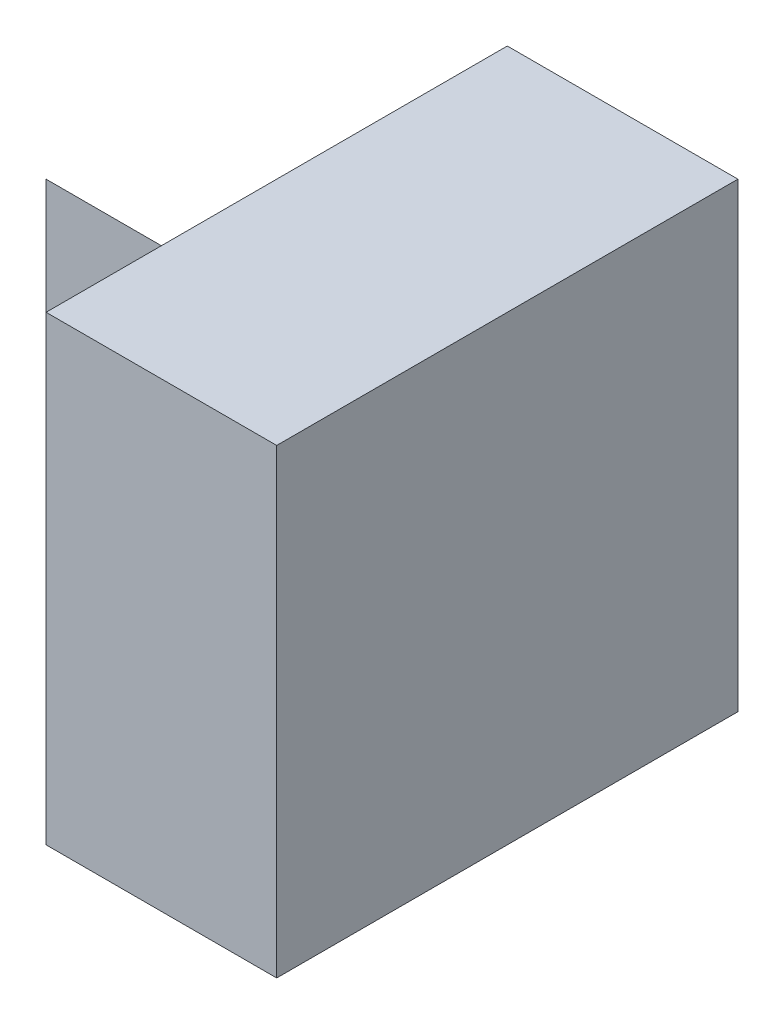
ISO-10303-21;
HEADER;
FILE_DESCRIPTION(('STEP AP214'),'2;1');
FILE_NAME('part.step','',(''),(''),'','','');
FILE_SCHEMA(('AUTOMOTIVE_DESIGN { 1 0 10303 214 1 1 1 1 }'));
ENDSEC;
DATA;
#1=APPLICATION_CONTEXT('core data for automotive mechanical design processes');
#2=APPLICATION_PROTOCOL_DEFINITION('international standard','automotive_design',2000,#1);
#3=PRODUCT_CONTEXT('',#1,'mechanical');
#4=PRODUCT('Part','Part','',(#3));
#5=PRODUCT_RELATED_PRODUCT_CATEGORY('part','',(#4));
#6=PRODUCT_DEFINITION_FORMATION('','',#4);
#7=PRODUCT_DEFINITION_CONTEXT('part definition',#1,'design');
#8=PRODUCT_DEFINITION('design','',#6,#7);
#9=PRODUCT_DEFINITION_SHAPE('','',#8);
#10=(LENGTH_UNIT() NAMED_UNIT(*) SI_UNIT(.MILLI.,.METRE.));
#11=(NAMED_UNIT(*) PLANE_ANGLE_UNIT() SI_UNIT($,.RADIAN.));
#12=(NAMED_UNIT(*) SI_UNIT($,.STERADIAN.) SOLID_ANGLE_UNIT());
#13=UNCERTAINTY_MEASURE_WITH_UNIT(LENGTH_MEASURE(1.E-05),#10,'distance_accuracy_value','');
#14=(GEOMETRIC_REPRESENTATION_CONTEXT(3) GLOBAL_UNCERTAINTY_ASSIGNED_CONTEXT((#13)) GLOBAL_UNIT_ASSIGNED_CONTEXT((#10,
#11,#12)) REPRESENTATION_CONTEXT('',''));
#15=CARTESIAN_POINT('',(0.,0.,0.));
#16=DIRECTION('',(0.,0.,1.));
#17=DIRECTION('',(1.,0.,0.));
#18=AXIS2_PLACEMENT_3D('',#15,#16,#17);
#19=CARTESIAN_POINT('',(2.,0.,-4.));
#20=DIRECTION('',(0.,0.,1.));
#21=DIRECTION('',(1.,0.,0.));
#22=AXIS2_PLACEMENT_3D('',#19,#20,#21);
#23=PLANE('',#22);
#24=DIRECTION('',(-1.,0.,0.));
#25=VECTOR('',#24,1.);
#26=CARTESIAN_POINT('',(2.,0.,-4.));
#27=LINE('',#26,#25);
#28=CARTESIAN_POINT('',(2.,0.,-4.));
#29=VERTEX_POINT('',#28);
#30=CARTESIAN_POINT('',(0.,0.,-4.));
#31=VERTEX_POINT('',#30);
#32=EDGE_CURVE('E42',#29,#31,#27,.T.);
#33=ORIENTED_EDGE('',*,*,#32,.T.);
#34=DIRECTION('',(0.,1.,0.));
#35=VECTOR('',#34,1.);
#36=CARTESIAN_POINT('',(0.,0.,-4.));
#37=LINE('',#36,#35);
#38=CARTESIAN_POINT('',(0.,4.,-4.));
#39=VERTEX_POINT('',#38);
#40=EDGE_CURVE('E114',#31,#39,#37,.T.);
#41=ORIENTED_EDGE('',*,*,#40,.T.);
#42=DIRECTION('',(-1.,0.,0.));
#43=VECTOR('',#42,1.);
#44=CARTESIAN_POINT('',(2.,4.,-4.));
#45=LINE('',#44,#43);
#46=CARTESIAN_POINT('',(2.,4.,-4.));
#47=VERTEX_POINT('',#46);
#48=EDGE_CURVE('E146',#47,#39,#45,.T.);
#49=ORIENTED_EDGE('',*,*,#48,.F.);
#50=DIRECTION('',(0.,1.,0.));
#51=VECTOR('',#50,1.);
#52=CARTESIAN_POINT('',(2.,0.,-4.));
#53=LINE('',#52,#51);
#54=EDGE_CURVE('E149',#29,#47,#53,.T.);
#55=ORIENTED_EDGE('',*,*,#54,.F.);
#56=EDGE_LOOP('',(#33,#41,#49,#55));
#57=FACE_BOUND('',#56,.T.);
#58=ADVANCED_FACE('F33',(#57),#23,.F.);
#59=CARTESIAN_POINT('',(-2.,0.,0.));
#60=DIRECTION('',(1.,0.,0.));
#61=DIRECTION('',(0.,0.,-1.));
#62=AXIS2_PLACEMENT_3D('',#59,#60,#61);
#63=PLANE('',#62);
#64=DIRECTION('',(0.,-0.832050294337844,-0.554700196225229));
#65=VECTOR('',#64,1.);
#66=CARTESIAN_POINT('',(-2.,1.84615384615385,-2.76923076923077));
#67=LINE('',#66,#65);
#68=CARTESIAN_POINT('',(-2.,3.,-2.));
#69=VERTEX_POINT('',#68);
#70=CARTESIAN_POINT('',(-2.,0.,-4.));
#71=VERTEX_POINT('',#70);
#72=EDGE_CURVE('E106',#69,#71,#67,.T.);
#73=ORIENTED_EDGE('',*,*,#72,.T.);
#74=DIRECTION('',(0.,0.,1.));
#75=VECTOR('',#74,1.);
#76=CARTESIAN_POINT('',(-2.,0.,-4.));
#77=LINE('',#76,#75);
#78=CARTESIAN_POINT('',(-2.,0.,-2.));
#79=VERTEX_POINT('',#78);
#80=EDGE_CURVE('E120',#71,#79,#77,.T.);
#81=ORIENTED_EDGE('',*,*,#80,.T.);
#82=DIRECTION('',(0.,1.,0.));
#83=VECTOR('',#82,1.);
#84=CARTESIAN_POINT('',(-2.,0.,-2.));
#85=LINE('',#84,#83);
#86=EDGE_CURVE('E111',#79,#69,#85,.T.);
#87=ORIENTED_EDGE('',*,*,#86,.T.);
#88=EDGE_LOOP('',(#73,#81,#87));
#89=FACE_BOUND('',#88,.T.);
#90=ADVANCED_FACE('F159',(#89),#63,.F.);
#91=CARTESIAN_POINT('',(2.,0.,0.));
#92=DIRECTION('',(0.,0.,-1.));
#93=DIRECTION('',(-1.,0.,0.));
#94=AXIS2_PLACEMENT_3D('',#91,#92,#93);
#95=PLANE('',#94);
#96=DIRECTION('',(0.,-1.,0.));
#97=VECTOR('',#96,1.);
#98=CARTESIAN_POINT('',(0.,0.,0.));
#99=LINE('',#98,#97);
#100=CARTESIAN_POINT('',(0.,4.,0.));
#101=VERTEX_POINT('',#100);
#102=CARTESIAN_POINT('',(0.,0.,0.));
#103=VERTEX_POINT('',#102);
#104=EDGE_CURVE('E130',#101,#103,#99,.T.);
#105=ORIENTED_EDGE('',*,*,#104,.T.);
#106=DIRECTION('',(-1.,0.,0.));
#107=VECTOR('',#106,1.);
#108=CARTESIAN_POINT('',(2.,0.,0.));
#109=LINE('',#108,#107);
#110=CARTESIAN_POINT('',(2.,0.,0.));
#111=VERTEX_POINT('',#110);
#112=EDGE_CURVE('E11',#111,#103,#109,.T.);
#113=ORIENTED_EDGE('',*,*,#112,.F.);
#114=DIRECTION('',(0.,-1.,0.));
#115=VECTOR('',#114,1.);
#116=CARTESIAN_POINT('',(2.,0.,0.));
#117=LINE('',#116,#115);
#118=CARTESIAN_POINT('',(2.,4.,0.));
#119=VERTEX_POINT('',#118);
#120=EDGE_CURVE('E152',#119,#111,#117,.T.);
#121=ORIENTED_EDGE('',*,*,#120,.F.);
#122=DIRECTION('',(-1.,0.,0.));
#123=VECTOR('',#122,1.);
#124=CARTESIAN_POINT('',(2.,4.,0.));
#125=LINE('',#124,#123);
#126=EDGE_CURVE('E147',#119,#101,#125,.T.);
#127=ORIENTED_EDGE('',*,*,#126,.T.);
#128=EDGE_LOOP('',(#105,#113,#121,#127));
#129=FACE_BOUND('',#128,.T.);
#130=ADVANCED_FACE('F35',(#129),#95,.F.);
#131=CARTESIAN_POINT('',(2.,0.,0.));
#132=DIRECTION('',(0.,1.,0.));
#133=DIRECTION('',(0.,0.,1.));
#134=AXIS2_PLACEMENT_3D('',#131,#132,#133);
#135=PLANE('',#134);
#136=DIRECTION('',(0.,0.,-1.));
#137=VECTOR('',#136,1.);
#138=CARTESIAN_POINT('',(0.,0.,0.));
#139=LINE('',#138,#137);
#140=CARTESIAN_POINT('',(0.,0.,-2.));
#141=VERTEX_POINT('',#140);
#142=EDGE_CURVE('E126',#103,#141,#139,.T.);
#143=ORIENTED_EDGE('',*,*,#142,.T.);
#144=DIRECTION('',(1.,0.,0.));
#145=VECTOR('',#144,1.);
#146=CARTESIAN_POINT('',(-2.,0.,-2.));
#147=LINE('',#146,#145);
#148=EDGE_CURVE('E110',#79,#141,#147,.T.);
#149=ORIENTED_EDGE('',*,*,#148,.F.);
#150=ORIENTED_EDGE('',*,*,#80,.F.);
#151=DIRECTION('',(-1.,0.,0.));
#152=VECTOR('',#151,1.);
#153=CARTESIAN_POINT('',(0.,0.,-4.));
#154=LINE('',#153,#152);
#155=EDGE_CURVE('E115',#31,#71,#154,.T.);
#156=ORIENTED_EDGE('',*,*,#155,.F.);
#157=ORIENTED_EDGE('',*,*,#32,.F.);
#158=DIRECTION('',(0.,0.,-1.));
#159=VECTOR('',#158,1.);
#160=CARTESIAN_POINT('',(2.,0.,0.));
#161=LINE('',#160,#159);
#162=EDGE_CURVE('E83',#111,#29,#161,.T.);
#163=ORIENTED_EDGE('',*,*,#162,.F.);
#164=ORIENTED_EDGE('',*,*,#112,.T.);
#165=EDGE_LOOP('',(#143,#149,#150,#156,#157,#163,#164));
#166=FACE_BOUND('',#165,.T.);
#167=ADVANCED_FACE('F160',(#166),#135,.F.);
#168=CARTESIAN_POINT('',(2.,4.,0.));
#169=DIRECTION('',(0.,-1.,0.));
#170=DIRECTION('',(0.,0.,-1.));
#171=AXIS2_PLACEMENT_3D('',#168,#169,#170);
#172=PLANE('',#171);
#173=DIRECTION('',(0.,0.,1.));
#174=VECTOR('',#173,1.);
#175=CARTESIAN_POINT('',(0.,4.,0.));
#176=LINE('',#175,#174);
#177=EDGE_CURVE('E76',#39,#101,#176,.T.);
#178=ORIENTED_EDGE('',*,*,#177,.T.);
#179=ORIENTED_EDGE('',*,*,#126,.F.);
#180=DIRECTION('',(0.,0.,1.));
#181=VECTOR('',#180,1.);
#182=CARTESIAN_POINT('',(2.,4.,0.));
#183=LINE('',#182,#181);
#184=EDGE_CURVE('E59',#47,#119,#183,.T.);
#185=ORIENTED_EDGE('',*,*,#184,.F.);
#186=ORIENTED_EDGE('',*,*,#48,.T.);
#187=EDGE_LOOP('',(#178,#179,#185,#186));
#188=FACE_BOUND('',#187,.T.);
#189=ADVANCED_FACE('F163',(#188),#172,.F.);
#190=CARTESIAN_POINT('',(2.,0.,0.));
#191=DIRECTION('',(-1.,0.,0.));
#192=DIRECTION('',(0.,0.,1.));
#193=AXIS2_PLACEMENT_3D('',#190,#191,#192);
#194=PLANE('',#193);
#195=ORIENTED_EDGE('',*,*,#120,.T.);
#196=ORIENTED_EDGE('',*,*,#162,.T.);
#197=ORIENTED_EDGE('',*,*,#54,.T.);
#198=ORIENTED_EDGE('',*,*,#184,.T.);
#199=EDGE_LOOP('',(#195,#196,#197,#198));
#200=FACE_BOUND('',#199,.T.);
#201=ADVANCED_FACE('F161',(#200),#194,.F.);
#202=CARTESIAN_POINT('',(0.,0.,0.));
#203=DIRECTION('',(-1.,0.,0.));
#204=DIRECTION('',(0.,0.,1.));
#205=AXIS2_PLACEMENT_3D('',#202,#203,#204);
#206=PLANE('',#205);
#207=ORIENTED_EDGE('',*,*,#40,.F.);
#208=DIRECTION('',(0.,-0.832050294337844,-0.554700196225229));
#209=VECTOR('',#208,1.);
#210=CARTESIAN_POINT('',(0.,1.84615384615385,-2.76923076923077));
#211=LINE('',#210,#209);
#212=CARTESIAN_POINT('',(0.,3.,-2.));
#213=VERTEX_POINT('',#212);
#214=EDGE_CURVE('E103',#213,#31,#211,.T.);
#215=ORIENTED_EDGE('',*,*,#214,.F.);
#216=DIRECTION('',(0.,1.,0.));
#217=VECTOR('',#216,1.);
#218=CARTESIAN_POINT('',(0.,0.,-2.));
#219=LINE('',#218,#217);
#220=EDGE_CURVE('E50',#141,#213,#219,.T.);
#221=ORIENTED_EDGE('',*,*,#220,.F.);
#222=ORIENTED_EDGE('',*,*,#142,.F.);
#223=ORIENTED_EDGE('',*,*,#104,.F.);
#224=ORIENTED_EDGE('',*,*,#177,.F.);
#225=EDGE_LOOP('',(#207,#215,#221,#222,#223,#224));
#226=FACE_BOUND('',#225,.T.);
#227=ADVANCED_FACE('F113',(#226),#206,.T.);
#228=CARTESIAN_POINT('',(-2.,0.,-2.));
#229=DIRECTION('',(0.,0.,-1.));
#230=DIRECTION('',(-1.,0.,0.));
#231=AXIS2_PLACEMENT_3D('',#228,#229,#230);
#232=PLANE('',#231);
#233=ORIENTED_EDGE('',*,*,#220,.T.);
#234=DIRECTION('',(1.,0.,0.));
#235=VECTOR('',#234,1.);
#236=CARTESIAN_POINT('',(-2.,3.,-2.));
#237=LINE('',#236,#235);
#238=EDGE_CURVE('E101',#69,#213,#237,.T.);
#239=ORIENTED_EDGE('',*,*,#238,.F.);
#240=ORIENTED_EDGE('',*,*,#86,.F.);
#241=ORIENTED_EDGE('',*,*,#148,.T.);
#242=EDGE_LOOP('',(#233,#239,#240,#241));
#243=FACE_BOUND('',#242,.T.);
#244=ADVANCED_FACE('F118',(#243),#232,.F.);
#245=CARTESIAN_POINT('',(0.,1.84615384615385,-2.76923076923077));
#246=DIRECTION('',(0.,0.554700196225229,-0.832050294337844));
#247=DIRECTION('',(0.,0.832050294337844,0.554700196225229));
#248=AXIS2_PLACEMENT_3D('',#245,#246,#247);
#249=PLANE('',#248);
#250=ORIENTED_EDGE('',*,*,#72,.F.);
#251=ORIENTED_EDGE('',*,*,#238,.T.);
#252=ORIENTED_EDGE('',*,*,#214,.T.);
#253=ORIENTED_EDGE('',*,*,#155,.T.);
#254=EDGE_LOOP('',(#250,#251,#252,#253));
#255=FACE_BOUND('',#254,.T.);
#256=ADVANCED_FACE('F102',(#255),#249,.T.);
#257=CLOSED_SHELL('',(#58,#90,#130,#167,#189,#201,#227,#244,#256));
#258=MANIFOLD_SOLID_BREP('B2',#257);
#259=ADVANCED_BREP_SHAPE_REPRESENTATION('',(#18,#258),#14);
#260=SHAPE_DEFINITION_REPRESENTATION(#9,#259);
ENDSEC;
END-ISO-10303-21;
